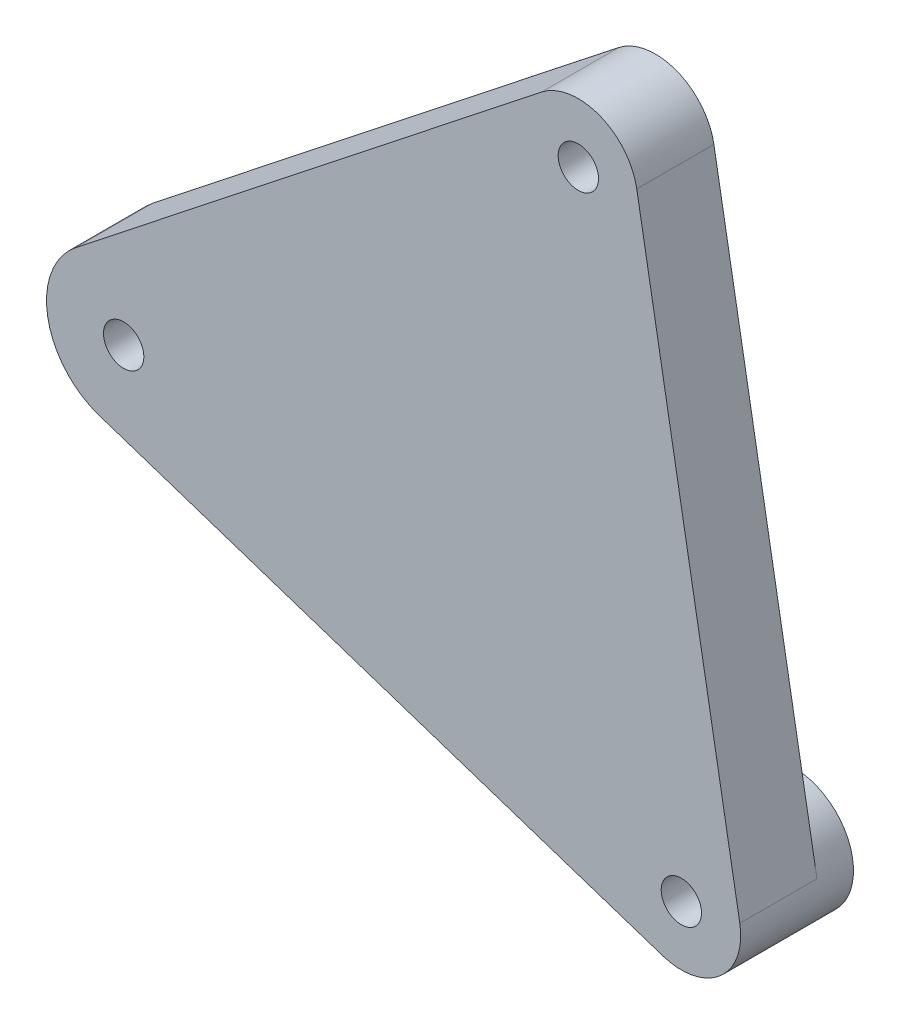
ISO-10303-21;
HEADER;
FILE_DESCRIPTION(('STEP AP214'),'2;1');
FILE_NAME('part.step','',(''),(''),'','','');
FILE_SCHEMA(('AUTOMOTIVE_DESIGN { 1 0 10303 214 1 1 1 1 }'));
ENDSEC;
DATA;
#1=APPLICATION_CONTEXT('core data for automotive mechanical design processes');
#2=APPLICATION_PROTOCOL_DEFINITION('international standard','automotive_design',2000,#1);
#3=PRODUCT_CONTEXT('',#1,'mechanical');
#4=PRODUCT('Part','Part','',(#3));
#5=PRODUCT_RELATED_PRODUCT_CATEGORY('part','',(#4));
#6=PRODUCT_DEFINITION_FORMATION('','',#4);
#7=PRODUCT_DEFINITION_CONTEXT('part definition',#1,'design');
#8=PRODUCT_DEFINITION('design','',#6,#7);
#9=PRODUCT_DEFINITION_SHAPE('','',#8);
#10=(LENGTH_UNIT() NAMED_UNIT(*) SI_UNIT(.MILLI.,.METRE.));
#11=(NAMED_UNIT(*) PLANE_ANGLE_UNIT() SI_UNIT($,.RADIAN.));
#12=(NAMED_UNIT(*) SI_UNIT($,.STERADIAN.) SOLID_ANGLE_UNIT());
#13=UNCERTAINTY_MEASURE_WITH_UNIT(LENGTH_MEASURE(1.E-05),#10,'distance_accuracy_value','');
#14=(GEOMETRIC_REPRESENTATION_CONTEXT(3) GLOBAL_UNCERTAINTY_ASSIGNED_CONTEXT((#13)) GLOBAL_UNIT_ASSIGNED_CONTEXT((#10,
#11,#12)) REPRESENTATION_CONTEXT('',''));
#15=CARTESIAN_POINT('',(0.,0.,0.));
#16=DIRECTION('',(0.,0.,1.));
#17=DIRECTION('',(1.,0.,0.));
#18=AXIS2_PLACEMENT_3D('',#15,#16,#17);
#19=CARTESIAN_POINT('',(155.,0.,0.25));
#20=DIRECTION('',(0.,0.,1.));
#21=DIRECTION('',(1.,0.,0.));
#22=AXIS2_PLACEMENT_3D('',#19,#20,#21);
#23=PLANE('',#22);
#24=CARTESIAN_POINT('',(193.302222155949,32.139380484327,0.25));
#25=DIRECTION('',(0.,0.,1.));
#26=DIRECTION('',(1.,0.,0.));
#27=AXIS2_PLACEMENT_3D('',#24,#25,#26);
#28=CIRCLE('',#27,1.69999999999999);
#29=CARTESIAN_POINT('',(195.002222155949,32.139380484327,0.25));
#30=VERTEX_POINT('',#29);
#31=EDGE_CURVE('E199',#30,#30,#28,.T.);
#32=ORIENTED_EDGE('',*,*,#31,.T.);
#33=EDGE_LOOP('',(#32));
#34=FACE_BOUND('',#33,.T.);
#35=CARTESIAN_POINT('',(155.,0.,0.25));
#36=DIRECTION('',(0.,0.,1.));
#37=DIRECTION('',(1.,0.,0.));
#38=AXIS2_PLACEMENT_3D('',#35,#36,#37);
#39=CIRCLE('',#38,1.69999999999998);
#40=CARTESIAN_POINT('',(156.7,0.,0.25));
#41=VERTEX_POINT('',#40);
#42=EDGE_CURVE('E205',#41,#41,#39,.T.);
#43=ORIENTED_EDGE('',*,*,#42,.T.);
#44=EDGE_LOOP('',(#43));
#45=FACE_BOUND('',#44,.T.);
#46=CARTESIAN_POINT('',(201.984631039296,-17.1010071662833,0.25));
#47=DIRECTION('',(0.,0.,-1.));
#48=DIRECTION('',(-1.,0.,0.));
#49=AXIS2_PLACEMENT_3D('',#46,#47,#48);
#50=CIRCLE('',#49,4.99999999999999);
#51=CARTESIAN_POINT('',(200.416253934333,-21.8486585073814,0.25));
#52=VERTEX_POINT('',#51);
#53=CARTESIAN_POINT('',(206.908669804357,-16.2327662779487,0.25));
#54=VERTEX_POINT('',#53);
#55=EDGE_CURVE('E11',#52,#54,#50,.T.);
#56=ORIENTED_EDGE('',*,*,#55,.F.);
#57=DIRECTION('',(0.949530268219609,-0.313675420992461,0.));
#58=VECTOR('',#57,1.);
#59=CARTESIAN_POINT('',(152.961109763549,-6.17194674342744,0.25));
#60=LINE('',#59,#58);
#61=CARTESIAN_POINT('',(152.961109763549,-6.17194674342744,0.25));
#62=VERTEX_POINT('',#61);
#63=EDGE_CURVE('E125',#62,#52,#60,.T.);
#64=ORIENTED_EDGE('',*,*,#63,.F.);
#65=CARTESIAN_POINT('',(155.,0.,0.25));
#66=DIRECTION('',(0.,0.,1.));
#67=DIRECTION('',(1.,0.,0.));
#68=AXIS2_PLACEMENT_3D('',#65,#66,#67);
#69=CIRCLE('',#68,6.5);
#70=CARTESIAN_POINT('',(150.973139780429,5.10239127978612,0.25));
#71=VERTEX_POINT('',#70);
#72=EDGE_CURVE('E122',#71,#62,#69,.T.);
#73=ORIENTED_EDGE('',*,*,#72,.F.);
#74=DIRECTION('',(-0.784983273813247,-0.619516956857064,0.));
#75=VECTOR('',#74,1.);
#76=CARTESIAN_POINT('',(190.204637371664,36.0642968533933,0.25));
#77=LINE('',#76,#75);
#78=CARTESIAN_POINT('',(190.204637371664,36.0642968533933,0.25));
#79=VERTEX_POINT('',#78);
#80=EDGE_CURVE('E80',#79,#71,#77,.T.);
#81=ORIENTED_EDGE('',*,*,#80,.F.);
#82=CARTESIAN_POINT('',(193.302222155949,32.139380484327,0.25));
#83=DIRECTION('',(0.,0.,1.));
#84=DIRECTION('',(1.,0.,0.));
#85=AXIS2_PLACEMENT_3D('',#82,#83,#84);
#86=CIRCLE('',#85,5.00000000000001);
#87=CARTESIAN_POINT('',(198.22626092101,33.0076213726617,0.25));
#88=VERTEX_POINT('',#87);
#89=EDGE_CURVE('E74',#88,#79,#86,.T.);
#90=ORIENTED_EDGE('',*,*,#89,.F.);
#91=DIRECTION('',(-0.173648177666933,0.984807753012208,0.));
#92=VECTOR('',#91,1.);
#93=CARTESIAN_POINT('',(198.22626092101,33.0076213726617,0.25));
#94=LINE('',#93,#92);
#95=EDGE_CURVE('E112',#54,#88,#94,.T.);
#96=ORIENTED_EDGE('',*,*,#95,.F.);
#97=EDGE_LOOP('',(#56,#64,#73,#81,#90,#96));
#98=FACE_BOUND('',#97,.T.);
#99=ADVANCED_FACE('F34',(#34,#45,#98),#23,.F.);
#100=CARTESIAN_POINT('',(155.,0.,6.75));
#101=DIRECTION('',(0.,0.,1.));
#102=DIRECTION('',(1.,0.,0.));
#103=AXIS2_PLACEMENT_3D('',#100,#101,#102);
#104=PLANE('',#103);
#105=CARTESIAN_POINT('',(155.,0.,6.75));
#106=DIRECTION('',(0.,0.,1.));
#107=DIRECTION('',(1.,0.,0.));
#108=AXIS2_PLACEMENT_3D('',#105,#106,#107);
#109=CIRCLE('',#108,1.69999999999998);
#110=CARTESIAN_POINT('',(156.7,0.,6.75));
#111=VERTEX_POINT('',#110);
#112=EDGE_CURVE('E207',#111,#111,#109,.T.);
#113=ORIENTED_EDGE('',*,*,#112,.F.);
#114=EDGE_LOOP('',(#113));
#115=FACE_BOUND('',#114,.T.);
#116=CARTESIAN_POINT('',(155.,0.,6.75));
#117=DIRECTION('',(0.,0.,1.));
#118=DIRECTION('',(1.,0.,0.));
#119=AXIS2_PLACEMENT_3D('',#116,#117,#118);
#120=CIRCLE('',#119,6.5);
#121=CARTESIAN_POINT('',(150.973139780429,5.10239127978612,6.75));
#122=VERTEX_POINT('',#121);
#123=CARTESIAN_POINT('',(152.961109763549,-6.17194674342744,6.75));
#124=VERTEX_POINT('',#123);
#125=EDGE_CURVE('E129',#122,#124,#120,.T.);
#126=ORIENTED_EDGE('',*,*,#125,.T.);
#127=DIRECTION('',(0.949530268219609,-0.313675420992461,0.));
#128=VECTOR('',#127,1.);
#129=CARTESIAN_POINT('',(152.961109763549,-6.17194674342744,6.75));
#130=LINE('',#129,#128);
#131=CARTESIAN_POINT('',(200.416253934333,-21.8486585073814,6.75));
#132=VERTEX_POINT('',#131);
#133=EDGE_CURVE('E89',#124,#132,#130,.T.);
#134=ORIENTED_EDGE('',*,*,#133,.T.);
#135=CARTESIAN_POINT('',(201.984631039296,-17.1010071662833,6.75));
#136=DIRECTION('',(0.,0.,1.));
#137=DIRECTION('',(1.,0.,0.));
#138=AXIS2_PLACEMENT_3D('',#135,#136,#137);
#139=CIRCLE('',#138,4.99999999999998);
#140=CARTESIAN_POINT('',(206.908669804357,-16.2327662779487,6.75));
#141=VERTEX_POINT('',#140);
#142=EDGE_CURVE('E104',#132,#141,#139,.T.);
#143=ORIENTED_EDGE('',*,*,#142,.T.);
#144=DIRECTION('',(-0.173648177666933,0.984807753012208,0.));
#145=VECTOR('',#144,1.);
#146=CARTESIAN_POINT('',(198.22626092101,33.0076213726617,6.75));
#147=LINE('',#146,#145);
#148=CARTESIAN_POINT('',(198.22626092101,33.0076213726617,6.75));
#149=VERTEX_POINT('',#148);
#150=EDGE_CURVE('E97',#141,#149,#147,.T.);
#151=ORIENTED_EDGE('',*,*,#150,.T.);
#152=CARTESIAN_POINT('',(193.302222155949,32.139380484327,6.75));
#153=DIRECTION('',(0.,0.,1.));
#154=DIRECTION('',(1.,0.,0.));
#155=AXIS2_PLACEMENT_3D('',#152,#153,#154);
#156=CIRCLE('',#155,5.00000000000001);
#157=CARTESIAN_POINT('',(190.204637371664,36.0642968533933,6.75));
#158=VERTEX_POINT('',#157);
#159=EDGE_CURVE('E102',#149,#158,#156,.T.);
#160=ORIENTED_EDGE('',*,*,#159,.T.);
#161=DIRECTION('',(-0.784983273813247,-0.619516956857064,0.));
#162=VECTOR('',#161,1.);
#163=CARTESIAN_POINT('',(190.204637371664,36.0642968533933,6.75));
#164=LINE('',#163,#162);
#165=EDGE_CURVE('E53',#158,#122,#164,.T.);
#166=ORIENTED_EDGE('',*,*,#165,.T.);
#167=EDGE_LOOP('',(#126,#134,#143,#151,#160,#166));
#168=FACE_BOUND('',#167,.T.);
#169=CARTESIAN_POINT('',(201.984631039296,-17.1010071662833,6.75));
#170=DIRECTION('',(0.,0.,1.));
#171=DIRECTION('',(1.,0.,0.));
#172=AXIS2_PLACEMENT_3D('',#169,#170,#171);
#173=CIRCLE('',#172,1.69999999999999);
#174=CARTESIAN_POINT('',(203.684631039296,-17.1010071662833,6.75));
#175=VERTEX_POINT('',#174);
#176=EDGE_CURVE('E126',#175,#175,#173,.T.);
#177=ORIENTED_EDGE('',*,*,#176,.F.);
#178=EDGE_LOOP('',(#177));
#179=FACE_BOUND('',#178,.T.);
#180=CARTESIAN_POINT('',(193.302222155949,32.139380484327,6.75));
#181=DIRECTION('',(0.,0.,1.));
#182=DIRECTION('',(1.,0.,0.));
#183=AXIS2_PLACEMENT_3D('',#180,#181,#182);
#184=CIRCLE('',#183,1.69999999999999);
#185=CARTESIAN_POINT('',(195.002222155949,32.139380484327,6.75));
#186=VERTEX_POINT('',#185);
#187=EDGE_CURVE('E202',#186,#186,#184,.T.);
#188=ORIENTED_EDGE('',*,*,#187,.F.);
#189=EDGE_LOOP('',(#188));
#190=FACE_BOUND('',#189,.T.);
#191=ADVANCED_FACE('F99',(#115,#168,#179,#190),#104,.T.);
#192=CARTESIAN_POINT('',(155.,0.,6.75));
#193=DIRECTION('',(0.,0.,-1.));
#194=DIRECTION('',(-1.,0.,0.));
#195=AXIS2_PLACEMENT_3D('',#192,#193,#194);
#196=CYLINDRICAL_SURFACE('',#195,6.5);
#197=ORIENTED_EDGE('',*,*,#72,.T.);
#198=DIRECTION('',(0.,0.,-1.));
#199=VECTOR('',#198,1.);
#200=CARTESIAN_POINT('',(152.961109763549,-6.17194674342744,6.75));
#201=LINE('',#200,#199);
#202=EDGE_CURVE('E44',#124,#62,#201,.T.);
#203=ORIENTED_EDGE('',*,*,#202,.F.);
#204=ORIENTED_EDGE('',*,*,#125,.F.);
#205=DIRECTION('',(0.,0.,-1.));
#206=VECTOR('',#205,1.);
#207=CARTESIAN_POINT('',(150.973139780429,5.10239127978612,6.75));
#208=LINE('',#207,#206);
#209=EDGE_CURVE('E118',#122,#71,#208,.T.);
#210=ORIENTED_EDGE('',*,*,#209,.T.);
#211=EDGE_LOOP('',(#197,#203,#204,#210));
#212=FACE_BOUND('',#211,.T.);
#213=ADVANCED_FACE('F36',(#212),#196,.T.);
#214=CARTESIAN_POINT('',(152.961109763549,-6.17194674342744,6.75));
#215=DIRECTION('',(0.313675420992461,0.949530268219609,0.));
#216=DIRECTION('',(-0.949530268219609,0.313675420992461,0.));
#217=AXIS2_PLACEMENT_3D('',#214,#215,#216);
#218=PLANE('',#217);
#219=ORIENTED_EDGE('',*,*,#63,.T.);
#220=DIRECTION('',(0.,0.,-1.));
#221=VECTOR('',#220,1.);
#222=CARTESIAN_POINT('',(200.416253934333,-21.8486585073814,6.75));
#223=LINE('',#222,#221);
#224=EDGE_CURVE('E133',#132,#52,#223,.T.);
#225=ORIENTED_EDGE('',*,*,#224,.F.);
#226=ORIENTED_EDGE('',*,*,#133,.F.);
#227=ORIENTED_EDGE('',*,*,#202,.T.);
#228=EDGE_LOOP('',(#219,#225,#226,#227));
#229=FACE_BOUND('',#228,.T.);
#230=ADVANCED_FACE('F151',(#229),#218,.F.);
#231=CARTESIAN_POINT('',(201.984631039296,-17.1010071662833,6.75));
#232=DIRECTION('',(0.,0.,-1.));
#233=DIRECTION('',(-1.,0.,0.));
#234=AXIS2_PLACEMENT_3D('',#231,#232,#233);
#235=CYLINDRICAL_SURFACE('',#234,4.99999999999998);
#236=ORIENTED_EDGE('',*,*,#224,.T.);
#237=ORIENTED_EDGE('',*,*,#55,.T.);
#238=DIRECTION('',(0.,0.,-1.));
#239=VECTOR('',#238,1.);
#240=CARTESIAN_POINT('',(206.908669804357,-16.2327662779487,6.75));
#241=LINE('',#240,#239);
#242=EDGE_CURVE('E113',#141,#54,#241,.T.);
#243=ORIENTED_EDGE('',*,*,#242,.F.);
#244=ORIENTED_EDGE('',*,*,#142,.F.);
#245=EDGE_LOOP('',(#236,#237,#243,#244));
#246=FACE_BOUND('',#245,.T.);
#247=CARTESIAN_POINT('',(201.984631039296,-17.1010071662833,-2.75));
#248=DIRECTION('',(0.,0.,-1.));
#249=DIRECTION('',(-1.,0.,0.));
#250=AXIS2_PLACEMENT_3D('',#247,#248,#249);
#251=CIRCLE('',#250,4.99999999999999);
#252=CARTESIAN_POINT('',(196.984631039296,-17.1010071662833,-2.75));
#253=VERTEX_POINT('',#252);
#254=EDGE_CURVE('E193',#253,#253,#251,.T.);
#255=ORIENTED_EDGE('',*,*,#254,.F.);
#256=EDGE_LOOP('',(#255));
#257=FACE_BOUND('',#256,.T.);
#258=ADVANCED_FACE('F147',(#246,#257),#235,.T.);
#259=CARTESIAN_POINT('',(198.22626092101,33.0076213726617,6.75));
#260=DIRECTION('',(-0.984807753012207,-0.173648177666933,0.));
#261=DIRECTION('',(0.173648177666933,-0.984807753012208,0.));
#262=AXIS2_PLACEMENT_3D('',#259,#260,#261);
#263=PLANE('',#262);
#264=ORIENTED_EDGE('',*,*,#95,.T.);
#265=DIRECTION('',(0.,0.,-1.));
#266=VECTOR('',#265,1.);
#267=CARTESIAN_POINT('',(198.22626092101,33.0076213726617,6.75));
#268=LINE('',#267,#266);
#269=EDGE_CURVE('E109',#149,#88,#268,.T.);
#270=ORIENTED_EDGE('',*,*,#269,.F.);
#271=ORIENTED_EDGE('',*,*,#150,.F.);
#272=ORIENTED_EDGE('',*,*,#242,.T.);
#273=EDGE_LOOP('',(#264,#270,#271,#272));
#274=FACE_BOUND('',#273,.T.);
#275=ADVANCED_FACE('F110',(#274),#263,.F.);
#276=CARTESIAN_POINT('',(193.302222155949,32.139380484327,6.75));
#277=DIRECTION('',(0.,0.,-1.));
#278=DIRECTION('',(-1.,0.,0.));
#279=AXIS2_PLACEMENT_3D('',#276,#277,#278);
#280=CYLINDRICAL_SURFACE('',#279,5.00000000000001);
#281=ORIENTED_EDGE('',*,*,#89,.T.);
#282=DIRECTION('',(0.,0.,-1.));
#283=VECTOR('',#282,1.);
#284=CARTESIAN_POINT('',(190.204637371664,36.0642968533933,6.75));
#285=LINE('',#284,#283);
#286=EDGE_CURVE('E114',#158,#79,#285,.T.);
#287=ORIENTED_EDGE('',*,*,#286,.F.);
#288=ORIENTED_EDGE('',*,*,#159,.F.);
#289=ORIENTED_EDGE('',*,*,#269,.T.);
#290=EDGE_LOOP('',(#281,#287,#288,#289));
#291=FACE_BOUND('',#290,.T.);
#292=ADVANCED_FACE('F116',(#291),#280,.T.);
#293=CARTESIAN_POINT('',(190.204637371664,36.0642968533933,6.75));
#294=DIRECTION('',(0.619516956857064,-0.784983273813247,0.));
#295=DIRECTION('',(0.784983273813247,0.619516956857064,0.));
#296=AXIS2_PLACEMENT_3D('',#293,#294,#295);
#297=PLANE('',#296);
#298=ORIENTED_EDGE('',*,*,#80,.T.);
#299=ORIENTED_EDGE('',*,*,#209,.F.);
#300=ORIENTED_EDGE('',*,*,#165,.F.);
#301=ORIENTED_EDGE('',*,*,#286,.T.);
#302=EDGE_LOOP('',(#298,#299,#300,#301));
#303=FACE_BOUND('',#302,.T.);
#304=ADVANCED_FACE('F155',(#303),#297,.F.);
#305=CARTESIAN_POINT('',(201.984631039296,-17.1010071662833,6.75));
#306=DIRECTION('',(0.,0.,-1.));
#307=DIRECTION('',(-1.,0.,0.));
#308=AXIS2_PLACEMENT_3D('',#305,#306,#307);
#309=CYLINDRICAL_SURFACE('',#308,1.69999999999999);
#310=ORIENTED_EDGE('',*,*,#176,.T.);
#311=EDGE_LOOP('',(#310));
#312=FACE_BOUND('',#311,.T.);
#313=CARTESIAN_POINT('',(201.984631039296,-17.1010071662833,-2.75));
#314=DIRECTION('',(0.,0.,-1.));
#315=DIRECTION('',(-1.,0.,0.));
#316=AXIS2_PLACEMENT_3D('',#313,#314,#315);
#317=CIRCLE('',#316,1.69999999999998);
#318=CARTESIAN_POINT('',(200.284631039296,-17.1010071662833,-2.75));
#319=VERTEX_POINT('',#318);
#320=EDGE_CURVE('E196',#319,#319,#317,.T.);
#321=ORIENTED_EDGE('',*,*,#320,.T.);
#322=EDGE_LOOP('',(#321));
#323=FACE_BOUND('',#322,.T.);
#324=ADVANCED_FACE('F157',(#312,#323),#309,.F.);
#325=CARTESIAN_POINT('',(155.,0.,6.75));
#326=DIRECTION('',(0.,0.,-1.));
#327=DIRECTION('',(-1.,0.,0.));
#328=AXIS2_PLACEMENT_3D('',#325,#326,#327);
#329=CYLINDRICAL_SURFACE('',#328,1.69999999999998);
#330=ORIENTED_EDGE('',*,*,#112,.T.);
#331=EDGE_LOOP('',(#330));
#332=FACE_BOUND('',#331,.T.);
#333=ORIENTED_EDGE('',*,*,#42,.F.);
#334=EDGE_LOOP('',(#333));
#335=FACE_BOUND('',#334,.T.);
#336=ADVANCED_FACE('F163',(#332,#335),#329,.F.);
#337=CARTESIAN_POINT('',(193.302222155949,32.139380484327,6.75));
#338=DIRECTION('',(0.,0.,-1.));
#339=DIRECTION('',(-1.,0.,0.));
#340=AXIS2_PLACEMENT_3D('',#337,#338,#339);
#341=CYLINDRICAL_SURFACE('',#340,1.69999999999999);
#342=ORIENTED_EDGE('',*,*,#187,.T.);
#343=EDGE_LOOP('',(#342));
#344=FACE_BOUND('',#343,.T.);
#345=ORIENTED_EDGE('',*,*,#31,.F.);
#346=EDGE_LOOP('',(#345));
#347=FACE_BOUND('',#346,.T.);
#348=ADVANCED_FACE('F180',(#344,#347),#341,.F.);
#349=CARTESIAN_POINT('',(201.984631039296,-17.1010071662833,-2.75));
#350=DIRECTION('',(0.,0.,-1.));
#351=DIRECTION('',(-1.,0.,0.));
#352=AXIS2_PLACEMENT_3D('',#349,#350,#351);
#353=PLANE('',#352);
#354=ORIENTED_EDGE('',*,*,#254,.T.);
#355=EDGE_LOOP('',(#354));
#356=FACE_BOUND('',#355,.T.);
#357=ORIENTED_EDGE('',*,*,#320,.F.);
#358=EDGE_LOOP('',(#357));
#359=FACE_BOUND('',#358,.T.);
#360=ADVANCED_FACE('F184',(#356,#359),#353,.T.);
#361=CLOSED_SHELL('',(#99,#191,#213,#230,#258,#275,#292,#304,#324,#336,#348,#360));
#362=MANIFOLD_SOLID_BREP('B2',#361);
#363=ADVANCED_BREP_SHAPE_REPRESENTATION('',(#18,#362),#14);
#364=SHAPE_DEFINITION_REPRESENTATION(#9,#363);
ENDSEC;
END-ISO-10303-21;
